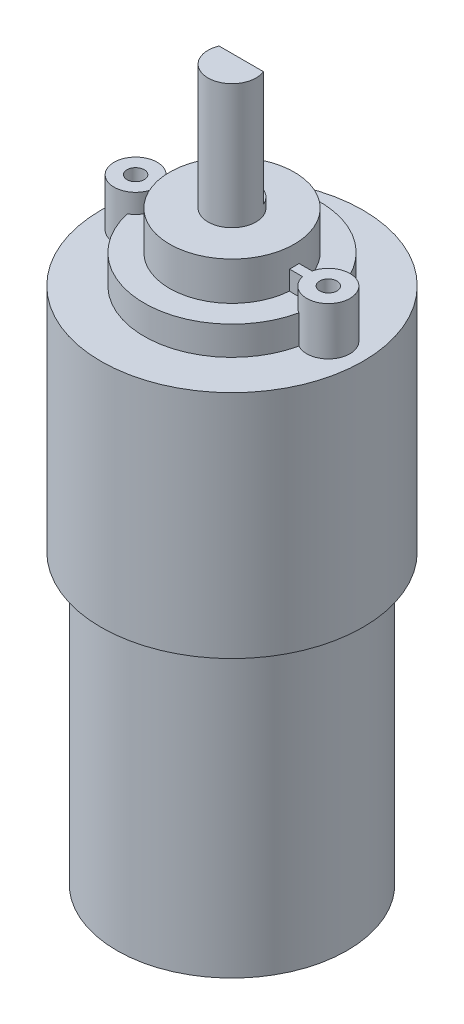
ISO-10303-21;
HEADER;
FILE_DESCRIPTION(('STEP AP214'),'2;1');
FILE_NAME('part.step','',(''),(''),'','','');
FILE_SCHEMA(('AUTOMOTIVE_DESIGN { 1 0 10303 214 1 1 1 1 }'));
ENDSEC;
DATA;
#1=APPLICATION_CONTEXT('core data for automotive mechanical design processes');
#2=APPLICATION_PROTOCOL_DEFINITION('international standard','automotive_design',2000,#1);
#3=PRODUCT_CONTEXT('',#1,'mechanical');
#4=PRODUCT('Part','Part','',(#3));
#5=PRODUCT_RELATED_PRODUCT_CATEGORY('part','',(#4));
#6=PRODUCT_DEFINITION_FORMATION('','',#4);
#7=PRODUCT_DEFINITION_CONTEXT('part definition',#1,'design');
#8=PRODUCT_DEFINITION('design','',#6,#7);
#9=PRODUCT_DEFINITION_SHAPE('','',#8);
#10=(LENGTH_UNIT() NAMED_UNIT(*) SI_UNIT(.MILLI.,.METRE.));
#11=(NAMED_UNIT(*) PLANE_ANGLE_UNIT() SI_UNIT($,.RADIAN.));
#12=(NAMED_UNIT(*) SI_UNIT($,.STERADIAN.) SOLID_ANGLE_UNIT());
#13=UNCERTAINTY_MEASURE_WITH_UNIT(LENGTH_MEASURE(1.E-05),#10,'distance_accuracy_value','');
#14=(GEOMETRIC_REPRESENTATION_CONTEXT(3) GLOBAL_UNCERTAINTY_ASSIGNED_CONTEXT((#13)) GLOBAL_UNIT_ASSIGNED_CONTEXT((#10,
#11,#12)) REPRESENTATION_CONTEXT('',''));
#15=CARTESIAN_POINT('',(0.,0.,0.));
#16=DIRECTION('',(0.,0.,1.));
#17=DIRECTION('',(1.,0.,0.));
#18=AXIS2_PLACEMENT_3D('',#15,#16,#17);
#19=CARTESIAN_POINT('',(0.,26.5,0.));
#20=DIRECTION('',(0.,1.,0.));
#21=DIRECTION('',(0.,0.,1.));
#22=AXIS2_PLACEMENT_3D('',#19,#20,#21);
#23=PLANE('',#22);
#24=DIRECTION('',(1.,0.,0.));
#25=VECTOR('',#24,1.);
#26=CARTESIAN_POINT('',(0.,26.5,0.500000000000004));
#27=LINE('',#26,#25);
#28=CARTESIAN_POINT('',(6.48074069840786,26.5,0.500000000000004));
#29=VERTEX_POINT('',#28);
#30=CARTESIAN_POINT('',(7.84625890315197,26.5,0.500000000000004));
#31=VERTEX_POINT('',#30);
#32=EDGE_CURVE('E167',#29,#31,#27,.T.);
#33=ORIENTED_EDGE('',*,*,#32,.F.);
#34=CARTESIAN_POINT('',(0.,26.5,0.));
#35=DIRECTION('',(0.,1.,0.));
#36=DIRECTION('',(0.,0.,1.));
#37=AXIS2_PLACEMENT_3D('',#34,#35,#36);
#38=CIRCLE('',#37,6.5);
#39=CARTESIAN_POINT('',(-6.48074069840786,26.5,0.500000000000004));
#40=VERTEX_POINT('',#39);
#41=EDGE_CURVE('E284',#40,#29,#38,.T.);
#42=ORIENTED_EDGE('',*,*,#41,.F.);
#43=CARTESIAN_POINT('',(-7.84625890315197,26.5,0.500000000000004));
#44=VERTEX_POINT('',#43);
#45=EDGE_CURVE('E310',#44,#40,#27,.T.);
#46=ORIENTED_EDGE('',*,*,#45,.F.);
#47=CARTESIAN_POINT('',(-10.04,26.5,0.));
#48=DIRECTION('',(0.,1.,0.));
#49=DIRECTION('',(0.,0.,1.));
#50=AXIS2_PLACEMENT_3D('',#47,#48,#49);
#51=CIRCLE('',#50,2.25);
#52=CARTESIAN_POINT('',(-8.93733067729084,26.5,1.96128028714819));
#53=VERTEX_POINT('',#52);
#54=EDGE_CURVE('E223',#44,#53,#51,.F.);
#55=ORIENTED_EDGE('',*,*,#54,.T.);
#56=CARTESIAN_POINT('',(0.,26.5,0.));
#57=DIRECTION('',(0.,1.,0.));
#58=DIRECTION('',(0.,0.,1.));
#59=AXIS2_PLACEMENT_3D('',#56,#57,#58);
#60=CIRCLE('',#59,9.15);
#61=CARTESIAN_POINT('',(8.93733067729083,26.5,1.9612802871482));
#62=VERTEX_POINT('',#61);
#63=EDGE_CURVE('E279',#53,#62,#60,.T.);
#64=ORIENTED_EDGE('',*,*,#63,.T.);
#65=CARTESIAN_POINT('',(10.04,26.5,0.));
#66=DIRECTION('',(0.,1.,0.));
#67=DIRECTION('',(0.,0.,1.));
#68=AXIS2_PLACEMENT_3D('',#65,#66,#67);
#69=CIRCLE('',#68,2.25);
#70=EDGE_CURVE('E238',#31,#62,#69,.T.);
#71=ORIENTED_EDGE('',*,*,#70,.F.);
#72=EDGE_LOOP('',(#33,#42,#46,#55,#64,#71));
#73=FACE_BOUND('',#72,.T.);
#74=ADVANCED_FACE('F40',(#73),#23,.T.);
#75=CARTESIAN_POINT('',(8.93733067729083,26.5,-1.9612802871482));
#76=VERTEX_POINT('',#75);
#77=CARTESIAN_POINT('',(7.84625890315197,26.5,-0.499999999999999));
#78=VERTEX_POINT('',#77);
#79=EDGE_CURVE('E241',#76,#78,#69,.T.);
#80=ORIENTED_EDGE('',*,*,#79,.F.);
#81=CARTESIAN_POINT('',(-8.93733067729083,26.5,-1.9612802871482));
#82=VERTEX_POINT('',#81);
#83=EDGE_CURVE('E332',#76,#82,#60,.T.);
#84=ORIENTED_EDGE('',*,*,#83,.T.);
#85=CARTESIAN_POINT('',(-7.84625890315197,26.5,-0.499999999999999));
#86=VERTEX_POINT('',#85);
#87=EDGE_CURVE('E219',#82,#86,#51,.F.);
#88=ORIENTED_EDGE('',*,*,#87,.T.);
#89=DIRECTION('',(1.,0.,0.));
#90=VECTOR('',#89,1.);
#91=CARTESIAN_POINT('',(0.,26.5,-0.499999999999999));
#92=LINE('',#91,#90);
#93=CARTESIAN_POINT('',(-6.48074069840786,26.5,-0.499999999999999));
#94=VERTEX_POINT('',#93);
#95=EDGE_CURVE('E308',#86,#94,#92,.T.);
#96=ORIENTED_EDGE('',*,*,#95,.T.);
#97=CARTESIAN_POINT('',(6.48074069840786,26.5,-0.499999999999999));
#98=VERTEX_POINT('',#97);
#99=EDGE_CURVE('E286',#98,#94,#38,.T.);
#100=ORIENTED_EDGE('',*,*,#99,.F.);
#101=EDGE_CURVE('E311',#98,#78,#92,.T.);
#102=ORIENTED_EDGE('',*,*,#101,.T.);
#103=EDGE_LOOP('',(#80,#84,#88,#96,#100,#102));
#104=FACE_BOUND('',#103,.T.);
#105=ADVANCED_FACE('F318',(#104),#23,.T.);
#106=CARTESIAN_POINT('',(0.,65.6871565633395,0.));
#107=DIRECTION('',(0.,1.,0.));
#108=DIRECTION('',(0.,0.,1.));
#109=AXIS2_PLACEMENT_3D('',#106,#107,#108);
#110=CYLINDRICAL_SURFACE('',#109,9.15);
#111=DIRECTION('',(0.,-1.,0.));
#112=VECTOR('',#111,1.);
#113=CARTESIAN_POINT('',(8.93733067729083,25.,-1.9612802871482));
#114=LINE('',#113,#112);
#115=CARTESIAN_POINT('',(8.93733067729083,23.5,-1.9612802871482));
#116=VERTEX_POINT('',#115);
#117=EDGE_CURVE('E240',#116,#76,#114,.F.);
#118=ORIENTED_EDGE('',*,*,#117,.F.);
#119=CARTESIAN_POINT('',(0.,23.5,0.));
#120=DIRECTION('',(0.,1.,0.));
#121=DIRECTION('',(0.,0.,1.));
#122=AXIS2_PLACEMENT_3D('',#119,#120,#121);
#123=CIRCLE('',#122,9.15);
#124=CARTESIAN_POINT('',(-8.93733067729083,23.5,-1.9612802871482));
#125=VERTEX_POINT('',#124);
#126=EDGE_CURVE('E339',#116,#125,#123,.T.);
#127=ORIENTED_EDGE('',*,*,#126,.T.);
#128=DIRECTION('',(0.,-1.,0.));
#129=VECTOR('',#128,1.);
#130=CARTESIAN_POINT('',(-8.93733067729083,25.,-1.9612802871482));
#131=LINE('',#130,#129);
#132=EDGE_CURVE('E216',#125,#82,#131,.F.);
#133=ORIENTED_EDGE('',*,*,#132,.T.);
#134=ORIENTED_EDGE('',*,*,#83,.F.);
#135=EDGE_LOOP('',(#118,#127,#133,#134));
#136=FACE_BOUND('',#135,.T.);
#137=ADVANCED_FACE('F338',(#136),#110,.T.);
#138=DIRECTION('',(0.,-1.,0.));
#139=VECTOR('',#138,1.);
#140=CARTESIAN_POINT('',(8.93733067729083,25.,1.9612802871482));
#141=LINE('',#140,#139);
#142=CARTESIAN_POINT('',(8.93733067729083,23.5,1.9612802871482));
#143=VERTEX_POINT('',#142);
#144=EDGE_CURVE('E235',#62,#143,#141,.T.);
#145=ORIENTED_EDGE('',*,*,#144,.F.);
#146=ORIENTED_EDGE('',*,*,#63,.F.);
#147=DIRECTION('',(0.,-1.,0.));
#148=VECTOR('',#147,1.);
#149=CARTESIAN_POINT('',(-8.93733067729083,25.,1.9612802871482));
#150=LINE('',#149,#148);
#151=CARTESIAN_POINT('',(-8.93733067729083,23.5,1.9612802871482));
#152=VERTEX_POINT('',#151);
#153=EDGE_CURVE('E222',#53,#152,#150,.T.);
#154=ORIENTED_EDGE('',*,*,#153,.T.);
#155=EDGE_CURVE('E274',#152,#143,#123,.T.);
#156=ORIENTED_EDGE('',*,*,#155,.T.);
#157=EDGE_LOOP('',(#145,#146,#154,#156));
#158=FACE_BOUND('',#157,.T.);
#159=ADVANCED_FACE('F378',(#158),#110,.T.);
#160=CARTESIAN_POINT('',(0.,23.5,0.));
#161=DIRECTION('',(0.,1.,0.));
#162=DIRECTION('',(0.,0.,1.));
#163=AXIS2_PLACEMENT_3D('',#160,#161,#162);
#164=PLANE('',#163);
#165=CARTESIAN_POINT('',(0.,23.5,0.));
#166=DIRECTION('',(0.,1.,0.));
#167=DIRECTION('',(0.,0.,1.));
#168=AXIS2_PLACEMENT_3D('',#165,#166,#167);
#169=CIRCLE('',#168,13.65);
#170=CARTESIAN_POINT('',(0.,23.5,13.65));
#171=VERTEX_POINT('',#170);
#172=EDGE_CURVE('E271',#171,#171,#169,.T.);
#173=ORIENTED_EDGE('',*,*,#172,.T.);
#174=EDGE_LOOP('',(#173));
#175=FACE_BOUND('',#174,.T.);
#176=CARTESIAN_POINT('',(10.04,23.5,0.));
#177=DIRECTION('',(0.,1.,0.));
#178=DIRECTION('',(0.,0.,1.));
#179=AXIS2_PLACEMENT_3D('',#176,#177,#178);
#180=CIRCLE('',#179,2.25);
#181=EDGE_CURVE('E305',#143,#116,#180,.T.);
#182=ORIENTED_EDGE('',*,*,#181,.F.);
#183=ORIENTED_EDGE('',*,*,#155,.F.);
#184=CARTESIAN_POINT('',(-10.04,23.5,0.));
#185=DIRECTION('',(0.,1.,0.));
#186=DIRECTION('',(0.,0.,1.));
#187=AXIS2_PLACEMENT_3D('',#184,#185,#186);
#188=CIRCLE('',#187,2.25);
#189=EDGE_CURVE('E299',#152,#125,#188,.F.);
#190=ORIENTED_EDGE('',*,*,#189,.T.);
#191=ORIENTED_EDGE('',*,*,#126,.F.);
#192=EDGE_LOOP('',(#182,#183,#190,#191));
#193=FACE_BOUND('',#192,.T.);
#194=ADVANCED_FACE('F367',(#175,#193),#164,.T.);
#195=CARTESIAN_POINT('',(0.,43.5,0.));
#196=DIRECTION('',(0.,1.,0.));
#197=DIRECTION('',(0.,0.,1.));
#198=AXIS2_PLACEMENT_3D('',#195,#196,#197);
#199=PLANE('',#198);
#200=DIRECTION('',(1.,0.,0.));
#201=VECTOR('',#200,1.);
#202=CARTESIAN_POINT('',(0.,43.5,-0.96));
#203=LINE('',#202,#201);
#204=CARTESIAN_POINT('',(-2.30833273164854,43.5,-0.96));
#205=VERTEX_POINT('',#204);
#206=CARTESIAN_POINT('',(2.30833273164854,43.5,-0.96));
#207=VERTEX_POINT('',#206);
#208=EDGE_CURVE('E251',#205,#207,#203,.T.);
#209=ORIENTED_EDGE('',*,*,#208,.F.);
#210=CARTESIAN_POINT('',(0.,43.5,0.));
#211=DIRECTION('',(0.,1.,0.));
#212=DIRECTION('',(0.,0.,1.));
#213=AXIS2_PLACEMENT_3D('',#210,#211,#212);
#214=CIRCLE('',#213,2.5);
#215=EDGE_CURVE('E293',#205,#207,#214,.T.);
#216=ORIENTED_EDGE('',*,*,#215,.T.);
#217=EDGE_LOOP('',(#209,#216));
#218=FACE_BOUND('',#217,.T.);
#219=ADVANCED_FACE('F42',(#218),#199,.T.);
#220=CARTESIAN_POINT('',(0.,65.6871565633395,0.));
#221=DIRECTION('',(0.,1.,0.));
#222=DIRECTION('',(0.,0.,1.));
#223=AXIS2_PLACEMENT_3D('',#220,#221,#222);
#224=CYLINDRICAL_SURFACE('',#223,2.5);
#225=DIRECTION('',(0.,1.,0.));
#226=VECTOR('',#225,1.);
#227=CARTESIAN_POINT('',(2.30833273164854,31.5,-0.96));
#228=LINE('',#227,#226);
#229=CARTESIAN_POINT('',(2.30833273164854,31.5,-0.96));
#230=VERTEX_POINT('',#229);
#231=EDGE_CURVE('E258',#230,#207,#228,.T.);
#232=ORIENTED_EDGE('',*,*,#231,.T.);
#233=ORIENTED_EDGE('',*,*,#215,.F.);
#234=DIRECTION('',(0.,1.,0.));
#235=VECTOR('',#234,1.);
#236=CARTESIAN_POINT('',(-2.30833273164854,31.5,-0.96));
#237=LINE('',#236,#235);
#238=CARTESIAN_POINT('',(-2.30833273164854,31.5,-0.96));
#239=VERTEX_POINT('',#238);
#240=EDGE_CURVE('E256',#239,#205,#237,.T.);
#241=ORIENTED_EDGE('',*,*,#240,.F.);
#242=CARTESIAN_POINT('',(0.,31.5,0.));
#243=DIRECTION('',(0.,1.,0.));
#244=DIRECTION('',(0.,0.,1.));
#245=AXIS2_PLACEMENT_3D('',#242,#243,#244);
#246=CIRCLE('',#245,2.5);
#247=EDGE_CURVE('E252',#230,#239,#246,.T.);
#248=ORIENTED_EDGE('',*,*,#247,.F.);
#249=EDGE_LOOP('',(#232,#233,#241,#248));
#250=FACE_BOUND('',#249,.T.);
#251=CARTESIAN_POINT('',(0.,30.5,0.));
#252=DIRECTION('',(0.,1.,0.));
#253=DIRECTION('',(0.,0.,1.));
#254=AXIS2_PLACEMENT_3D('',#251,#252,#253);
#255=CIRCLE('',#254,2.5);
#256=CARTESIAN_POINT('',(0.,30.5,2.5));
#257=VERTEX_POINT('',#256);
#258=EDGE_CURVE('E290',#257,#257,#255,.T.);
#259=ORIENTED_EDGE('',*,*,#258,.T.);
#260=EDGE_LOOP('',(#259));
#261=FACE_BOUND('',#260,.T.);
#262=ADVANCED_FACE('F574',(#250,#261),#224,.T.);
#263=CARTESIAN_POINT('',(0.,30.5,0.));
#264=DIRECTION('',(0.,1.,0.));
#265=DIRECTION('',(0.,0.,1.));
#266=AXIS2_PLACEMENT_3D('',#263,#264,#265);
#267=PLANE('',#266);
#268=CARTESIAN_POINT('',(0.,30.5,0.));
#269=DIRECTION('',(0.,1.,0.));
#270=DIRECTION('',(0.,0.,1.));
#271=AXIS2_PLACEMENT_3D('',#268,#269,#270);
#272=CIRCLE('',#271,6.5);
#273=CARTESIAN_POINT('',(0.,30.5,6.5));
#274=VERTEX_POINT('',#273);
#275=EDGE_CURVE('E287',#274,#274,#272,.T.);
#276=ORIENTED_EDGE('',*,*,#275,.T.);
#277=EDGE_LOOP('',(#276));
#278=FACE_BOUND('',#277,.T.);
#279=ORIENTED_EDGE('',*,*,#258,.F.);
#280=EDGE_LOOP('',(#279));
#281=FACE_BOUND('',#280,.T.);
#282=ADVANCED_FACE('F518',(#278,#281),#267,.T.);
#283=CARTESIAN_POINT('',(0.,65.6871565633395,0.));
#284=DIRECTION('',(0.,1.,0.));
#285=DIRECTION('',(0.,0.,1.));
#286=AXIS2_PLACEMENT_3D('',#283,#284,#285);
#287=CYLINDRICAL_SURFACE('',#286,6.5);
#288=DIRECTION('',(0.,1.,0.));
#289=VECTOR('',#288,1.);
#290=CARTESIAN_POINT('',(-6.48074069840786,65.6871565633395,0.500000000000004));
#291=LINE('',#290,#289);
#292=CARTESIAN_POINT('',(-6.48074069840786,28.5,0.500000000000004));
#293=VERTEX_POINT('',#292);
#294=EDGE_CURVE('E249',#40,#293,#291,.T.);
#295=ORIENTED_EDGE('',*,*,#294,.F.);
#296=ORIENTED_EDGE('',*,*,#41,.T.);
#297=DIRECTION('',(0.,1.,0.));
#298=VECTOR('',#297,1.);
#299=CARTESIAN_POINT('',(6.48074069840786,65.6871565633395,0.500000000000004));
#300=LINE('',#299,#298);
#301=CARTESIAN_POINT('',(6.48074069840786,28.5,0.500000000000004));
#302=VERTEX_POINT('',#301);
#303=EDGE_CURVE('E55',#302,#29,#300,.F.);
#304=ORIENTED_EDGE('',*,*,#303,.F.);
#305=CARTESIAN_POINT('',(0.,28.5,0.));
#306=DIRECTION('',(0.,1.,0.));
#307=DIRECTION('',(0.,0.,1.));
#308=AXIS2_PLACEMENT_3D('',#305,#306,#307);
#309=CIRCLE('',#308,6.5);
#310=CARTESIAN_POINT('',(6.48074069840786,28.5,-0.499999999999999));
#311=VERTEX_POINT('',#310);
#312=EDGE_CURVE('E44',#311,#302,#309,.F.);
#313=ORIENTED_EDGE('',*,*,#312,.F.);
#314=DIRECTION('',(0.,1.,0.));
#315=VECTOR('',#314,1.);
#316=CARTESIAN_POINT('',(6.48074069840786,65.6871565633395,-0.499999999999999));
#317=LINE('',#316,#315);
#318=EDGE_CURVE('E243',#311,#98,#317,.F.);
#319=ORIENTED_EDGE('',*,*,#318,.T.);
#320=ORIENTED_EDGE('',*,*,#99,.T.);
#321=DIRECTION('',(0.,1.,0.));
#322=VECTOR('',#321,1.);
#323=CARTESIAN_POINT('',(-6.48074069840786,65.6871565633395,-0.499999999999999));
#324=LINE('',#323,#322);
#325=CARTESIAN_POINT('',(-6.48074069840786,28.5,-0.499999999999999));
#326=VERTEX_POINT('',#325);
#327=EDGE_CURVE('E245',#94,#326,#324,.T.);
#328=ORIENTED_EDGE('',*,*,#327,.T.);
#329=EDGE_CURVE('E11',#293,#326,#309,.F.);
#330=ORIENTED_EDGE('',*,*,#329,.F.);
#331=EDGE_LOOP('',(#295,#296,#304,#313,#319,#320,#328,#330));
#332=FACE_BOUND('',#331,.T.);
#333=ORIENTED_EDGE('',*,*,#275,.F.);
#334=EDGE_LOOP('',(#333));
#335=FACE_BOUND('',#334,.T.);
#336=ADVANCED_FACE('F325',(#332,#335),#287,.T.);
#337=CARTESIAN_POINT('',(0.,65.6871565633395,0.));
#338=DIRECTION('',(0.,1.,0.));
#339=DIRECTION('',(0.,0.,1.));
#340=AXIS2_PLACEMENT_3D('',#337,#338,#339);
#341=CYLINDRICAL_SURFACE('',#340,13.65);
#342=CARTESIAN_POINT('',(0.,-0.5,0.));
#343=DIRECTION('',(0.,1.,0.));
#344=DIRECTION('',(0.,0.,1.));
#345=AXIS2_PLACEMENT_3D('',#342,#343,#344);
#346=CIRCLE('',#345,13.65);
#347=CARTESIAN_POINT('',(0.,-0.5,13.65));
#348=VERTEX_POINT('',#347);
#349=EDGE_CURVE('E268',#348,#348,#346,.T.);
#350=ORIENTED_EDGE('',*,*,#349,.T.);
#351=EDGE_LOOP('',(#350));
#352=FACE_BOUND('',#351,.T.);
#353=ORIENTED_EDGE('',*,*,#172,.F.);
#354=EDGE_LOOP('',(#353));
#355=FACE_BOUND('',#354,.T.);
#356=ADVANCED_FACE('F517',(#352,#355),#341,.T.);
#357=CARTESIAN_POINT('',(0.,-0.5,0.));
#358=DIRECTION('',(0.,-1.,0.));
#359=DIRECTION('',(0.,0.,-1.));
#360=AXIS2_PLACEMENT_3D('',#357,#358,#359);
#361=PLANE('',#360);
#362=CARTESIAN_POINT('',(0.,-0.5,0.));
#363=DIRECTION('',(0.,1.,0.));
#364=DIRECTION('',(0.,0.,1.));
#365=AXIS2_PLACEMENT_3D('',#362,#363,#364);
#366=CIRCLE('',#365,12.);
#367=CARTESIAN_POINT('',(0.,-0.5,12.));
#368=VERTEX_POINT('',#367);
#369=EDGE_CURVE('E265',#368,#368,#366,.T.);
#370=ORIENTED_EDGE('',*,*,#369,.T.);
#371=EDGE_LOOP('',(#370));
#372=FACE_BOUND('',#371,.T.);
#373=ORIENTED_EDGE('',*,*,#349,.F.);
#374=EDGE_LOOP('',(#373));
#375=FACE_BOUND('',#374,.T.);
#376=ADVANCED_FACE('F604',(#372,#375),#361,.T.);
#377=CARTESIAN_POINT('',(0.,65.6871565633395,0.));
#378=DIRECTION('',(0.,1.,0.));
#379=DIRECTION('',(0.,0.,1.));
#380=AXIS2_PLACEMENT_3D('',#377,#378,#379);
#381=CYLINDRICAL_SURFACE('',#380,12.);
#382=CARTESIAN_POINT('',(0.,-30.5,0.));
#383=DIRECTION('',(0.,1.,0.));
#384=DIRECTION('',(0.,0.,1.));
#385=AXIS2_PLACEMENT_3D('',#382,#383,#384);
#386=CIRCLE('',#385,12.);
#387=CARTESIAN_POINT('',(0.,-30.5,12.));
#388=VERTEX_POINT('',#387);
#389=EDGE_CURVE('E261',#388,#388,#386,.T.);
#390=ORIENTED_EDGE('',*,*,#389,.T.);
#391=EDGE_LOOP('',(#390));
#392=FACE_BOUND('',#391,.T.);
#393=ORIENTED_EDGE('',*,*,#369,.F.);
#394=EDGE_LOOP('',(#393));
#395=FACE_BOUND('',#394,.T.);
#396=ADVANCED_FACE('F593',(#392,#395),#381,.T.);
#397=CARTESIAN_POINT('',(0.,-30.5,0.));
#398=DIRECTION('',(0.,-1.,0.));
#399=DIRECTION('',(0.,0.,-1.));
#400=AXIS2_PLACEMENT_3D('',#397,#398,#399);
#401=PLANE('',#400);
#402=ORIENTED_EDGE('',*,*,#389,.F.);
#403=EDGE_LOOP('',(#402));
#404=FACE_BOUND('',#403,.T.);
#405=ADVANCED_FACE('F566',(#404),#401,.T.);
#406=CARTESIAN_POINT('',(0.,31.5,-0.96));
#407=DIRECTION('',(0.,0.,1.));
#408=DIRECTION('',(1.,0.,0.));
#409=AXIS2_PLACEMENT_3D('',#406,#407,#408);
#410=PLANE('',#409);
#411=ORIENTED_EDGE('',*,*,#208,.T.);
#412=ORIENTED_EDGE('',*,*,#231,.F.);
#413=DIRECTION('',(1.,0.,0.));
#414=VECTOR('',#413,1.);
#415=CARTESIAN_POINT('',(0.,31.5,-0.96));
#416=LINE('',#415,#414);
#417=EDGE_CURVE('E254',#239,#230,#416,.T.);
#418=ORIENTED_EDGE('',*,*,#417,.F.);
#419=ORIENTED_EDGE('',*,*,#240,.T.);
#420=EDGE_LOOP('',(#411,#412,#418,#419));
#421=FACE_BOUND('',#420,.T.);
#422=ADVANCED_FACE('F556',(#421),#410,.F.);
#423=CARTESIAN_POINT('',(0.,31.5,0.));
#424=DIRECTION('',(0.,1.,0.));
#425=DIRECTION('',(0.,0.,1.));
#426=AXIS2_PLACEMENT_3D('',#423,#424,#425);
#427=PLANE('',#426);
#428=ORIENTED_EDGE('',*,*,#247,.T.);
#429=ORIENTED_EDGE('',*,*,#417,.T.);
#430=EDGE_LOOP('',(#428,#429));
#431=FACE_BOUND('',#430,.T.);
#432=ADVANCED_FACE('F507',(#431),#427,.T.);
#433=CARTESIAN_POINT('',(-10.04,28.5,0.));
#434=DIRECTION('',(0.,-1.,0.));
#435=DIRECTION('',(0.,0.,-1.));
#436=AXIS2_PLACEMENT_3D('',#433,#434,#435);
#437=CYLINDRICAL_SURFACE('',#436,2.25);
#438=ORIENTED_EDGE('',*,*,#54,.F.);
#439=DIRECTION('',(0.,-1.,0.));
#440=VECTOR('',#439,1.);
#441=CARTESIAN_POINT('',(-7.84625890315197,28.5,0.500000000000004));
#442=LINE('',#441,#440);
#443=CARTESIAN_POINT('',(-7.84625890315197,28.5,0.500000000000004));
#444=VERTEX_POINT('',#443);
#445=EDGE_CURVE('E201',#444,#44,#442,.T.);
#446=ORIENTED_EDGE('',*,*,#445,.F.);
#447=CARTESIAN_POINT('',(-10.04,28.5,0.));
#448=DIRECTION('',(0.,1.,0.));
#449=DIRECTION('',(0.,0.,1.));
#450=AXIS2_PLACEMENT_3D('',#447,#448,#449);
#451=CIRCLE('',#450,2.25);
#452=CARTESIAN_POINT('',(-7.84625890315197,28.5,-0.499999999999999));
#453=VERTEX_POINT('',#452);
#454=EDGE_CURVE('E192',#453,#444,#451,.T.);
#455=ORIENTED_EDGE('',*,*,#454,.F.);
#456=DIRECTION('',(0.,-1.,0.));
#457=VECTOR('',#456,1.);
#458=CARTESIAN_POINT('',(-7.84625890315197,28.5,-0.499999999999999));
#459=LINE('',#458,#457);
#460=EDGE_CURVE('E204',#453,#86,#459,.T.);
#461=ORIENTED_EDGE('',*,*,#460,.T.);
#462=ORIENTED_EDGE('',*,*,#87,.F.);
#463=ORIENTED_EDGE('',*,*,#132,.F.);
#464=ORIENTED_EDGE('',*,*,#189,.F.);
#465=ORIENTED_EDGE('',*,*,#153,.F.);
#466=EDGE_LOOP('',(#438,#446,#455,#461,#462,#463,#464,#465));
#467=FACE_BOUND('',#466,.T.);
#468=ADVANCED_FACE('F334',(#467),#437,.T.);
#469=CARTESIAN_POINT('',(0.,28.5,-0.499999999999999));
#470=DIRECTION('',(0.,0.,1.));
#471=DIRECTION('',(1.,0.,0.));
#472=AXIS2_PLACEMENT_3D('',#469,#470,#471);
#473=PLANE('',#472);
#474=ORIENTED_EDGE('',*,*,#327,.F.);
#475=ORIENTED_EDGE('',*,*,#95,.F.);
#476=ORIENTED_EDGE('',*,*,#460,.F.);
#477=DIRECTION('',(-1.,0.,0.));
#478=VECTOR('',#477,1.);
#479=CARTESIAN_POINT('',(0.,28.5,-0.499999999999999));
#480=LINE('',#479,#478);
#481=EDGE_CURVE('E187',#326,#453,#480,.T.);
#482=ORIENTED_EDGE('',*,*,#481,.F.);
#483=EDGE_LOOP('',(#474,#475,#476,#482));
#484=FACE_BOUND('',#483,.T.);
#485=ADVANCED_FACE('F330',(#484),#473,.F.);
#486=CARTESIAN_POINT('',(0.,28.5,0.500000000000004));
#487=DIRECTION('',(0.,0.,1.));
#488=DIRECTION('',(1.,0.,0.));
#489=AXIS2_PLACEMENT_3D('',#486,#487,#488);
#490=PLANE('',#489);
#491=ORIENTED_EDGE('',*,*,#45,.T.);
#492=ORIENTED_EDGE('',*,*,#294,.T.);
#493=DIRECTION('',(-1.,0.,0.));
#494=VECTOR('',#493,1.);
#495=CARTESIAN_POINT('',(0.,28.5,0.500000000000004));
#496=LINE('',#495,#494);
#497=EDGE_CURVE('E180',#293,#444,#496,.T.);
#498=ORIENTED_EDGE('',*,*,#497,.T.);
#499=ORIENTED_EDGE('',*,*,#445,.T.);
#500=EDGE_LOOP('',(#491,#492,#498,#499));
#501=FACE_BOUND('',#500,.T.);
#502=ADVANCED_FACE('F394',(#501),#490,.T.);
#503=CARTESIAN_POINT('',(-10.04,28.5,0.));
#504=DIRECTION('',(0.,-1.,0.));
#505=DIRECTION('',(0.,0.,-1.));
#506=AXIS2_PLACEMENT_3D('',#503,#504,#505);
#507=CYLINDRICAL_SURFACE('',#506,0.9);
#508=CARTESIAN_POINT('',(-10.04,28.5,0.));
#509=DIRECTION('',(0.,1.,0.));
#510=DIRECTION('',(0.,0.,1.));
#511=AXIS2_PLACEMENT_3D('',#508,#509,#510);
#512=CIRCLE('',#511,0.9);
#513=CARTESIAN_POINT('',(-10.04,28.5,0.900000000000001));
#514=VERTEX_POINT('',#513);
#515=EDGE_CURVE('E198',#514,#514,#512,.T.);
#516=ORIENTED_EDGE('',*,*,#515,.T.);
#517=EDGE_LOOP('',(#516));
#518=FACE_BOUND('',#517,.T.);
#519=CARTESIAN_POINT('',(-10.04,26.5,0.));
#520=DIRECTION('',(0.,1.,0.));
#521=DIRECTION('',(0.,0.,1.));
#522=AXIS2_PLACEMENT_3D('',#519,#520,#521);
#523=CIRCLE('',#522,0.9);
#524=CARTESIAN_POINT('',(-9.14910856573705,26.5,-0.12772021123107));
#525=VERTEX_POINT('',#524);
#526=CARTESIAN_POINT('',(-9.14910856573705,26.5,0.127720211231075));
#527=VERTEX_POINT('',#526);
#528=EDGE_CURVE('E210',#525,#527,#523,.F.);
#529=ORIENTED_EDGE('',*,*,#528,.T.);
#530=DIRECTION('',(0.,-1.,0.));
#531=VECTOR('',#530,1.);
#532=CARTESIAN_POINT('',(-9.14910856573705,26.,0.127720211231075));
#533=LINE('',#532,#531);
#534=CARTESIAN_POINT('',(-9.14910856573705,23.5,0.127720211231075));
#535=VERTEX_POINT('',#534);
#536=EDGE_CURVE('E213',#527,#535,#533,.T.);
#537=ORIENTED_EDGE('',*,*,#536,.T.);
#538=CARTESIAN_POINT('',(-10.04,23.5,0.));
#539=DIRECTION('',(0.,1.,0.));
#540=DIRECTION('',(0.,0.,1.));
#541=AXIS2_PLACEMENT_3D('',#538,#539,#540);
#542=CIRCLE('',#541,0.9);
#543=CARTESIAN_POINT('',(-9.14910856573705,23.5,-0.127720211231072));
#544=VERTEX_POINT('',#543);
#545=EDGE_CURVE('E296',#535,#544,#542,.F.);
#546=ORIENTED_EDGE('',*,*,#545,.T.);
#547=DIRECTION('',(0.,-1.,0.));
#548=VECTOR('',#547,1.);
#549=CARTESIAN_POINT('',(-9.14910856573705,26.,-0.127720211231072));
#550=LINE('',#549,#548);
#551=EDGE_CURVE('E171',#544,#525,#550,.F.);
#552=ORIENTED_EDGE('',*,*,#551,.T.);
#553=EDGE_LOOP('',(#529,#537,#546,#552));
#554=FACE_BOUND('',#553,.T.);
#555=ADVANCED_FACE('F350',(#518,#554),#507,.F.);
#556=CARTESIAN_POINT('',(0.,28.5,0.));
#557=DIRECTION('',(0.,1.,0.));
#558=DIRECTION('',(0.,0.,1.));
#559=AXIS2_PLACEMENT_3D('',#556,#557,#558);
#560=PLANE('',#559);
#561=ORIENTED_EDGE('',*,*,#515,.F.);
#562=EDGE_LOOP('',(#561));
#563=FACE_BOUND('',#562,.T.);
#564=ORIENTED_EDGE('',*,*,#497,.F.);
#565=ORIENTED_EDGE('',*,*,#329,.T.);
#566=ORIENTED_EDGE('',*,*,#481,.T.);
#567=ORIENTED_EDGE('',*,*,#454,.T.);
#568=EDGE_LOOP('',(#564,#565,#566,#567));
#569=FACE_BOUND('',#568,.T.);
#570=ADVANCED_FACE('F375',(#563,#569),#560,.T.);
#571=ORIENTED_EDGE('',*,*,#545,.F.);
#572=EDGE_CURVE('E277',#544,#535,#123,.T.);
#573=ORIENTED_EDGE('',*,*,#572,.F.);
#574=EDGE_LOOP('',(#571,#573));
#575=FACE_BOUND('',#574,.T.);
#576=ADVANCED_FACE('F368',(#575),#164,.T.);
#577=ORIENTED_EDGE('',*,*,#536,.F.);
#578=EDGE_CURVE('E282',#525,#527,#60,.T.);
#579=ORIENTED_EDGE('',*,*,#578,.F.);
#580=ORIENTED_EDGE('',*,*,#551,.F.);
#581=ORIENTED_EDGE('',*,*,#572,.T.);
#582=EDGE_LOOP('',(#577,#579,#580,#581));
#583=FACE_BOUND('',#582,.T.);
#584=ADVANCED_FACE('F345',(#583),#110,.T.);
#585=ORIENTED_EDGE('',*,*,#528,.F.);
#586=ORIENTED_EDGE('',*,*,#578,.T.);
#587=EDGE_LOOP('',(#585,#586));
#588=FACE_BOUND('',#587,.T.);
#589=ADVANCED_FACE('F352',(#588),#23,.T.);
#590=CARTESIAN_POINT('',(7.84625890315197,28.5,0.500000000000004));
#591=VERTEX_POINT('',#590);
#592=EDGE_CURVE('E166',#591,#302,#496,.T.);
#593=ORIENTED_EDGE('',*,*,#592,.T.);
#594=ORIENTED_EDGE('',*,*,#303,.T.);
#595=ORIENTED_EDGE('',*,*,#32,.T.);
#596=DIRECTION('',(0.,-1.,0.));
#597=VECTOR('',#596,1.);
#598=CARTESIAN_POINT('',(7.84625890315197,28.5,0.500000000000004));
#599=LINE('',#598,#597);
#600=EDGE_CURVE('E163',#591,#31,#599,.T.);
#601=ORIENTED_EDGE('',*,*,#600,.F.);
#602=EDGE_LOOP('',(#593,#594,#595,#601));
#603=FACE_BOUND('',#602,.T.);
#604=ADVANCED_FACE('F165',(#603),#490,.T.);
#605=CARTESIAN_POINT('',(10.04,28.5,0.));
#606=DIRECTION('',(0.,-1.,0.));
#607=DIRECTION('',(0.,0.,-1.));
#608=AXIS2_PLACEMENT_3D('',#605,#606,#607);
#609=CYLINDRICAL_SURFACE('',#608,2.25);
#610=ORIENTED_EDGE('',*,*,#117,.T.);
#611=ORIENTED_EDGE('',*,*,#79,.T.);
#612=DIRECTION('',(0.,-1.,0.));
#613=VECTOR('',#612,1.);
#614=CARTESIAN_POINT('',(7.84625890315197,28.5,-0.499999999999999));
#615=LINE('',#614,#613);
#616=CARTESIAN_POINT('',(7.84625890315197,28.5,-0.499999999999999));
#617=VERTEX_POINT('',#616);
#618=EDGE_CURVE('E172',#617,#78,#615,.T.);
#619=ORIENTED_EDGE('',*,*,#618,.F.);
#620=CARTESIAN_POINT('',(10.04,28.5,0.));
#621=DIRECTION('',(0.,1.,0.));
#622=DIRECTION('',(0.,0.,1.));
#623=AXIS2_PLACEMENT_3D('',#620,#621,#622);
#624=CIRCLE('',#623,2.25);
#625=EDGE_CURVE('E179',#617,#591,#624,.F.);
#626=ORIENTED_EDGE('',*,*,#625,.T.);
#627=ORIENTED_EDGE('',*,*,#600,.T.);
#628=ORIENTED_EDGE('',*,*,#70,.T.);
#629=ORIENTED_EDGE('',*,*,#144,.T.);
#630=ORIENTED_EDGE('',*,*,#181,.T.);
#631=EDGE_LOOP('',(#610,#611,#619,#626,#627,#628,#629,#630));
#632=FACE_BOUND('',#631,.T.);
#633=ADVANCED_FACE('F183',(#632),#609,.T.);
#634=ORIENTED_EDGE('',*,*,#318,.F.);
#635=EDGE_CURVE('E189',#617,#311,#480,.T.);
#636=ORIENTED_EDGE('',*,*,#635,.F.);
#637=ORIENTED_EDGE('',*,*,#618,.T.);
#638=ORIENTED_EDGE('',*,*,#101,.F.);
#639=EDGE_LOOP('',(#634,#636,#637,#638));
#640=FACE_BOUND('',#639,.T.);
#641=ADVANCED_FACE('F324',(#640),#473,.F.);
#642=CARTESIAN_POINT('',(10.04,28.5,0.));
#643=DIRECTION('',(0.,-1.,0.));
#644=DIRECTION('',(0.,0.,-1.));
#645=AXIS2_PLACEMENT_3D('',#642,#643,#644);
#646=CYLINDRICAL_SURFACE('',#645,0.9);
#647=DIRECTION('',(0.,-1.,0.));
#648=VECTOR('',#647,1.);
#649=CARTESIAN_POINT('',(9.14910856573705,26.,-0.127720211231072));
#650=LINE('',#649,#648);
#651=CARTESIAN_POINT('',(9.14910856573705,23.5,-0.127720211231072));
#652=VERTEX_POINT('',#651);
#653=CARTESIAN_POINT('',(9.14910856573705,26.5,-0.127720211231072));
#654=VERTEX_POINT('',#653);
#655=EDGE_CURVE('E232',#652,#654,#650,.F.);
#656=ORIENTED_EDGE('',*,*,#655,.F.);
#657=CARTESIAN_POINT('',(10.04,23.5,0.));
#658=DIRECTION('',(0.,1.,0.));
#659=DIRECTION('',(0.,0.,1.));
#660=AXIS2_PLACEMENT_3D('',#657,#658,#659);
#661=CIRCLE('',#660,0.9);
#662=CARTESIAN_POINT('',(9.14910856573705,23.5,0.127720211231075));
#663=VERTEX_POINT('',#662);
#664=EDGE_CURVE('E302',#663,#652,#661,.T.);
#665=ORIENTED_EDGE('',*,*,#664,.F.);
#666=DIRECTION('',(0.,-1.,0.));
#667=VECTOR('',#666,1.);
#668=CARTESIAN_POINT('',(9.14910856573705,26.,0.127720211231075));
#669=LINE('',#668,#667);
#670=CARTESIAN_POINT('',(9.14910856573705,26.5,0.127720211231075));
#671=VERTEX_POINT('',#670);
#672=EDGE_CURVE('E226',#671,#663,#669,.T.);
#673=ORIENTED_EDGE('',*,*,#672,.F.);
#674=CARTESIAN_POINT('',(10.04,26.5,0.));
#675=DIRECTION('',(0.,1.,0.));
#676=DIRECTION('',(0.,0.,1.));
#677=AXIS2_PLACEMENT_3D('',#674,#675,#676);
#678=CIRCLE('',#677,0.9);
#679=EDGE_CURVE('E229',#654,#671,#678,.T.);
#680=ORIENTED_EDGE('',*,*,#679,.F.);
#681=EDGE_LOOP('',(#656,#665,#673,#680));
#682=FACE_BOUND('',#681,.T.);
#683=CARTESIAN_POINT('',(10.04,28.5,0.));
#684=DIRECTION('',(0.,1.,0.));
#685=DIRECTION('',(0.,0.,1.));
#686=AXIS2_PLACEMENT_3D('',#683,#684,#685);
#687=CIRCLE('',#686,0.9);
#688=CARTESIAN_POINT('',(10.04,28.5,0.900000000000001));
#689=VERTEX_POINT('',#688);
#690=EDGE_CURVE('E195',#689,#689,#687,.F.);
#691=ORIENTED_EDGE('',*,*,#690,.F.);
#692=EDGE_LOOP('',(#691));
#693=FACE_BOUND('',#692,.T.);
#694=ADVANCED_FACE('F361',(#682,#693),#646,.F.);
#695=ORIENTED_EDGE('',*,*,#635,.T.);
#696=ORIENTED_EDGE('',*,*,#312,.T.);
#697=ORIENTED_EDGE('',*,*,#592,.F.);
#698=ORIENTED_EDGE('',*,*,#625,.F.);
#699=EDGE_LOOP('',(#695,#696,#697,#698));
#700=FACE_BOUND('',#699,.T.);
#701=ORIENTED_EDGE('',*,*,#690,.T.);
#702=EDGE_LOOP('',(#701));
#703=FACE_BOUND('',#702,.T.);
#704=ADVANCED_FACE('F177',(#700,#703),#560,.T.);
#705=EDGE_CURVE('E278',#663,#652,#123,.T.);
#706=ORIENTED_EDGE('',*,*,#705,.F.);
#707=ORIENTED_EDGE('',*,*,#664,.T.);
#708=EDGE_LOOP('',(#706,#707));
#709=FACE_BOUND('',#708,.T.);
#710=ADVANCED_FACE('F364',(#709),#164,.T.);
#711=ORIENTED_EDGE('',*,*,#705,.T.);
#712=ORIENTED_EDGE('',*,*,#655,.T.);
#713=EDGE_CURVE('E283',#671,#654,#60,.T.);
#714=ORIENTED_EDGE('',*,*,#713,.F.);
#715=ORIENTED_EDGE('',*,*,#672,.T.);
#716=EDGE_LOOP('',(#711,#712,#714,#715));
#717=FACE_BOUND('',#716,.T.);
#718=ADVANCED_FACE('F358',(#717),#110,.T.);
#719=ORIENTED_EDGE('',*,*,#713,.T.);
#720=ORIENTED_EDGE('',*,*,#679,.T.);
#721=EDGE_LOOP('',(#719,#720));
#722=FACE_BOUND('',#721,.T.);
#723=ADVANCED_FACE('F356',(#722),#23,.T.);
#724=CLOSED_SHELL('',(#74,#105,#137,#159,#194,#219,#262,#282,#336,#356,#376,#396,#405,#422,#432,
#468,#485,#502,#555,#570,#576,#584,#589,#604,#633,#641,#694,#704,#710,#718,#723));
#725=MANIFOLD_SOLID_BREP('B2',#724);
#726=ADVANCED_BREP_SHAPE_REPRESENTATION('',(#18,#725),#14);
#727=SHAPE_DEFINITION_REPRESENTATION(#9,#726);
ENDSEC;
END-ISO-10303-21;
